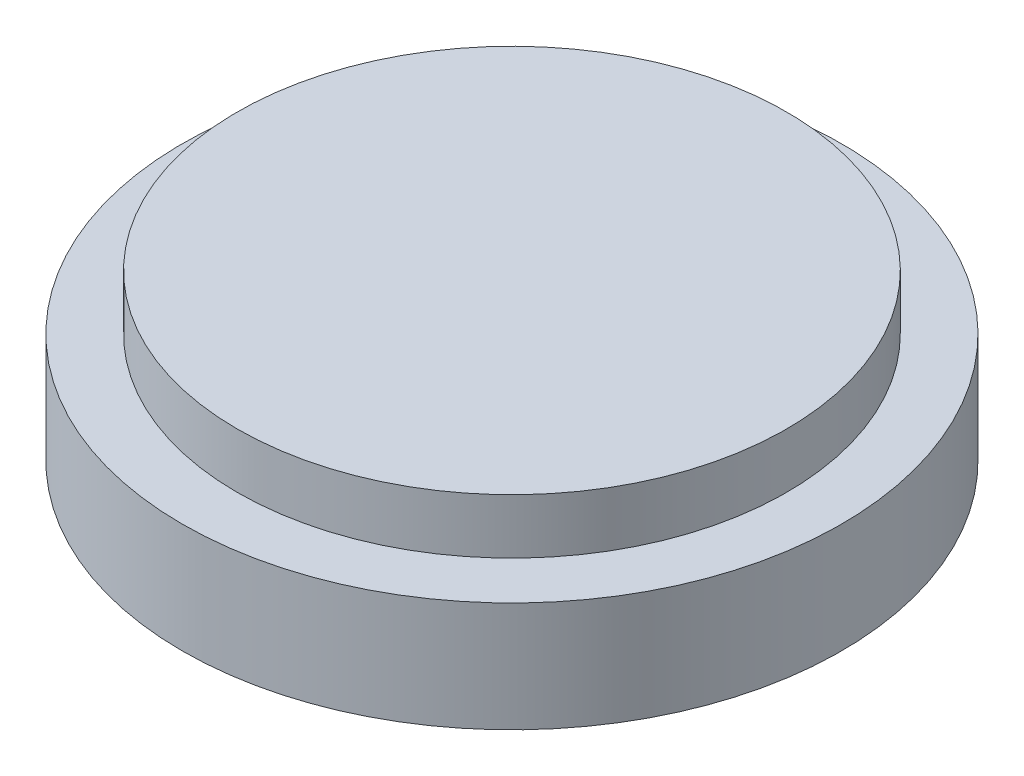
ISO-10303-21;
HEADER;
FILE_DESCRIPTION(('STEP AP214'),'2;1');
FILE_NAME('part.step','',(''),(''),'','','');
FILE_SCHEMA(('AUTOMOTIVE_DESIGN { 1 0 10303 214 1 1 1 1 }'));
ENDSEC;
DATA;
#1=APPLICATION_CONTEXT('core data for automotive mechanical design processes');
#2=APPLICATION_PROTOCOL_DEFINITION('international standard','automotive_design',2000,#1);
#3=PRODUCT_CONTEXT('',#1,'mechanical');
#4=PRODUCT('Part','Part','',(#3));
#5=PRODUCT_RELATED_PRODUCT_CATEGORY('part','',(#4));
#6=PRODUCT_DEFINITION_FORMATION('','',#4);
#7=PRODUCT_DEFINITION_CONTEXT('part definition',#1,'design');
#8=PRODUCT_DEFINITION('design','',#6,#7);
#9=PRODUCT_DEFINITION_SHAPE('','',#8);
#10=(LENGTH_UNIT() NAMED_UNIT(*) SI_UNIT(.MILLI.,.METRE.));
#11=(NAMED_UNIT(*) PLANE_ANGLE_UNIT() SI_UNIT($,.RADIAN.));
#12=(NAMED_UNIT(*) SI_UNIT($,.STERADIAN.) SOLID_ANGLE_UNIT());
#13=UNCERTAINTY_MEASURE_WITH_UNIT(LENGTH_MEASURE(1.E-05),#10,'distance_accuracy_value','');
#14=(GEOMETRIC_REPRESENTATION_CONTEXT(3) GLOBAL_UNCERTAINTY_ASSIGNED_CONTEXT((#13)) GLOBAL_UNIT_ASSIGNED_CONTEXT((#10,
#11,#12)) REPRESENTATION_CONTEXT('',''));
#15=CARTESIAN_POINT('',(0.,0.,0.));
#16=DIRECTION('',(0.,0.,1.));
#17=DIRECTION('',(1.,0.,0.));
#18=AXIS2_PLACEMENT_3D('',#15,#16,#17);
#19=CARTESIAN_POINT('',(0.,200.,0.));
#20=DIRECTION('',(0.,-1.,0.));
#21=DIRECTION('',(0.,0.,-1.));
#22=AXIS2_PLACEMENT_3D('',#19,#20,#21);
#23=CYLINDRICAL_SURFACE('',#22,600.);
#24=CARTESIAN_POINT('',(0.,200.,0.));
#25=DIRECTION('',(0.,1.,0.));
#26=DIRECTION('',(0.,0.,1.));
#27=AXIS2_PLACEMENT_3D('',#24,#25,#26);
#28=CIRCLE('',#27,600.);
#29=CARTESIAN_POINT('',(0.,200.,600.));
#30=VERTEX_POINT('',#29);
#31=EDGE_CURVE('E51',#30,#30,#28,.T.);
#32=ORIENTED_EDGE('',*,*,#31,.F.);
#33=EDGE_LOOP('',(#32));
#34=FACE_BOUND('',#33,.T.);
#35=CARTESIAN_POINT('',(0.,0.,0.));
#36=DIRECTION('',(0.,1.,0.));
#37=DIRECTION('',(0.,0.,1.));
#38=AXIS2_PLACEMENT_3D('',#35,#36,#37);
#39=CIRCLE('',#38,600.);
#40=CARTESIAN_POINT('',(0.,0.,600.));
#41=VERTEX_POINT('',#40);
#42=EDGE_CURVE('E46',#41,#41,#39,.T.);
#43=ORIENTED_EDGE('',*,*,#42,.T.);
#44=EDGE_LOOP('',(#43));
#45=FACE_BOUND('',#44,.T.);
#46=ADVANCED_FACE('F43',(#34,#45),#23,.T.);
#47=CARTESIAN_POINT('',(0.,200.,0.));
#48=DIRECTION('',(0.,1.,0.));
#49=DIRECTION('',(0.,0.,1.));
#50=AXIS2_PLACEMENT_3D('',#47,#48,#49);
#51=PLANE('',#50);
#52=CARTESIAN_POINT('',(0.,200.,0.));
#53=DIRECTION('',(0.,1.,0.));
#54=DIRECTION('',(0.,0.,1.));
#55=AXIS2_PLACEMENT_3D('',#52,#53,#54);
#56=CIRCLE('',#55,500.);
#57=CARTESIAN_POINT('',(0.,200.,500.));
#58=VERTEX_POINT('',#57);
#59=EDGE_CURVE('E10',#58,#58,#56,.T.);
#60=ORIENTED_EDGE('',*,*,#59,.F.);
#61=EDGE_LOOP('',(#60));
#62=FACE_BOUND('',#61,.T.);
#63=ORIENTED_EDGE('',*,*,#31,.T.);
#64=EDGE_LOOP('',(#63));
#65=FACE_BOUND('',#64,.T.);
#66=ADVANCED_FACE('F71',(#62,#65),#51,.T.);
#67=CARTESIAN_POINT('',(0.,0.,0.));
#68=DIRECTION('',(0.,1.,0.));
#69=DIRECTION('',(0.,0.,1.));
#70=AXIS2_PLACEMENT_3D('',#67,#68,#69);
#71=PLANE('',#70);
#72=ORIENTED_EDGE('',*,*,#42,.F.);
#73=EDGE_LOOP('',(#72));
#74=FACE_BOUND('',#73,.T.);
#75=ADVANCED_FACE('F68',(#74),#71,.F.);
#76=CARTESIAN_POINT('',(0.,300.,0.));
#77=DIRECTION('',(0.,-1.,0.));
#78=DIRECTION('',(0.,0.,-1.));
#79=AXIS2_PLACEMENT_3D('',#76,#77,#78);
#80=CYLINDRICAL_SURFACE('',#79,500.);
#81=CARTESIAN_POINT('',(0.,300.,0.));
#82=DIRECTION('',(0.,1.,0.));
#83=DIRECTION('',(0.,0.,1.));
#84=AXIS2_PLACEMENT_3D('',#81,#82,#83);
#85=CIRCLE('',#84,500.);
#86=CARTESIAN_POINT('',(0.,300.,500.));
#87=VERTEX_POINT('',#86);
#88=EDGE_CURVE('E58',#87,#87,#85,.T.);
#89=ORIENTED_EDGE('',*,*,#88,.F.);
#90=EDGE_LOOP('',(#89));
#91=FACE_BOUND('',#90,.T.);
#92=ORIENTED_EDGE('',*,*,#59,.T.);
#93=EDGE_LOOP('',(#92));
#94=FACE_BOUND('',#93,.T.);
#95=ADVANCED_FACE('F70',(#91,#94),#80,.T.);
#96=CARTESIAN_POINT('',(0.,300.,0.));
#97=DIRECTION('',(0.,1.,0.));
#98=DIRECTION('',(0.,0.,1.));
#99=AXIS2_PLACEMENT_3D('',#96,#97,#98);
#100=PLANE('',#99);
#101=ORIENTED_EDGE('',*,*,#88,.T.);
#102=EDGE_LOOP('',(#101));
#103=FACE_BOUND('',#102,.T.);
#104=ADVANCED_FACE('F77',(#103),#100,.T.);
#105=CLOSED_SHELL('',(#46,#66,#75,#95,#104));
#106=MANIFOLD_SOLID_BREP('B2',#105);
#107=ADVANCED_BREP_SHAPE_REPRESENTATION('',(#18,#106),#14);
#108=SHAPE_DEFINITION_REPRESENTATION(#9,#107);
ENDSEC;
END-ISO-10303-21;
